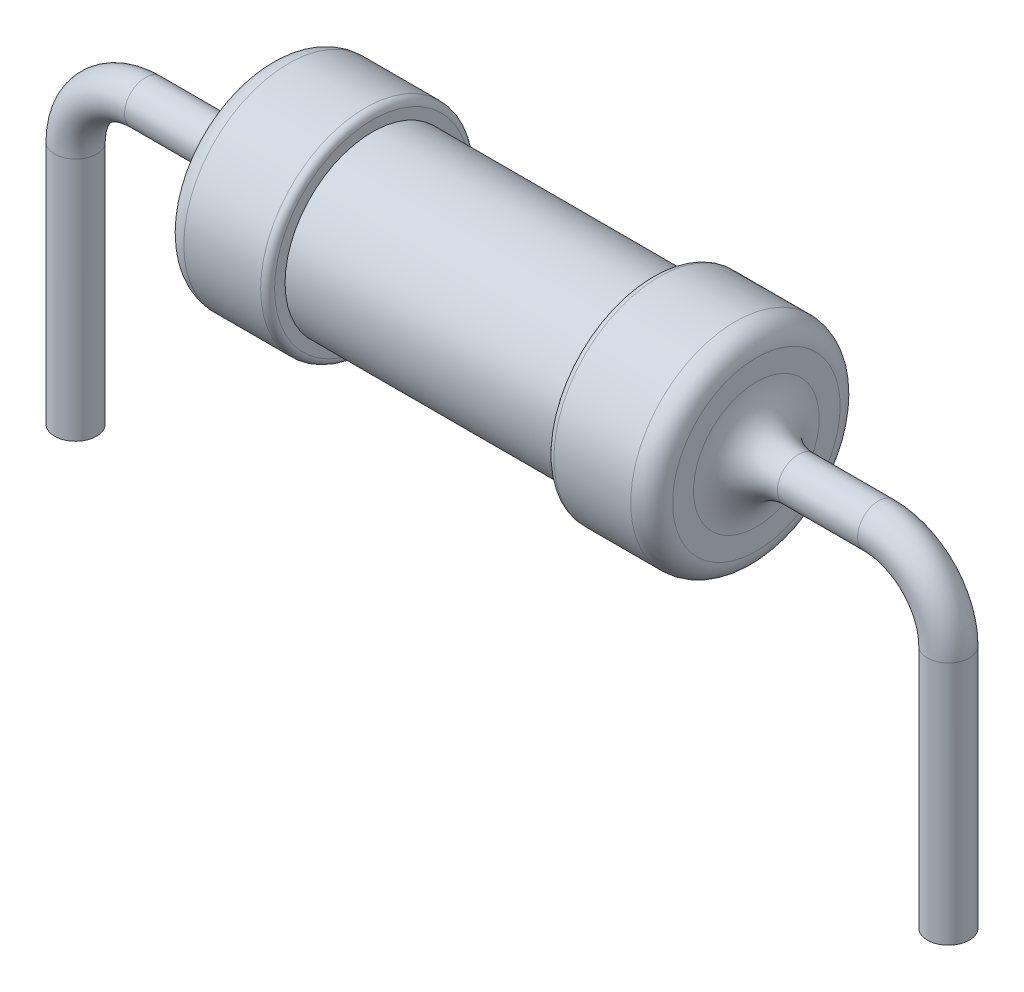
ISO-10303-21;
HEADER;
FILE_DESCRIPTION(('STEP AP214'),'2;1');
FILE_NAME('part.step','',(''),(''),'','','');
FILE_SCHEMA(('AUTOMOTIVE_DESIGN { 1 0 10303 214 1 1 1 1 }'));
ENDSEC;
DATA;
#1=APPLICATION_CONTEXT('core data for automotive mechanical design processes');
#2=APPLICATION_PROTOCOL_DEFINITION('international standard','automotive_design',2000,#1);
#3=PRODUCT_CONTEXT('',#1,'mechanical');
#4=PRODUCT('Part','Part','',(#3));
#5=PRODUCT_RELATED_PRODUCT_CATEGORY('part','',(#4));
#6=PRODUCT_DEFINITION_FORMATION('','',#4);
#7=PRODUCT_DEFINITION_CONTEXT('part definition',#1,'design');
#8=PRODUCT_DEFINITION('design','',#6,#7);
#9=PRODUCT_DEFINITION_SHAPE('','',#8);
#10=(LENGTH_UNIT() NAMED_UNIT(*) SI_UNIT(.MILLI.,.METRE.));
#11=(NAMED_UNIT(*) PLANE_ANGLE_UNIT() SI_UNIT($,.RADIAN.));
#12=(NAMED_UNIT(*) SI_UNIT($,.STERADIAN.) SOLID_ANGLE_UNIT());
#13=UNCERTAINTY_MEASURE_WITH_UNIT(LENGTH_MEASURE(1.E-05),#10,'distance_accuracy_value','');
#14=(GEOMETRIC_REPRESENTATION_CONTEXT(3) GLOBAL_UNCERTAINTY_ASSIGNED_CONTEXT((#13)) GLOBAL_UNIT_ASSIGNED_CONTEXT((#10,
#11,#12)) REPRESENTATION_CONTEXT('',''));
#15=CARTESIAN_POINT('',(0.,0.,0.));
#16=DIRECTION('',(0.,0.,1.));
#17=DIRECTION('',(1.,0.,0.));
#18=AXIS2_PLACEMENT_3D('',#15,#16,#17);
#19=CARTESIAN_POINT('',(2.5,0.,0.));
#20=DIRECTION('',(-1.,0.,0.));
#21=DIRECTION('',(0.,0.,1.));
#22=AXIS2_PLACEMENT_3D('',#19,#20,#21);
#23=CYLINDRICAL_SURFACE('',#22,1.25);
#24=CARTESIAN_POINT('',(2.,0.,0.));
#25=DIRECTION('',(1.,0.,0.));
#26=DIRECTION('',(0.,0.,-1.));
#27=AXIS2_PLACEMENT_3D('',#24,#25,#26);
#28=CIRCLE('',#27,1.25);
#29=CARTESIAN_POINT('',(2.,0.,-1.25));
#30=VERTEX_POINT('',#29);
#31=EDGE_CURVE('E101',#30,#30,#28,.T.);
#32=ORIENTED_EDGE('',*,*,#31,.F.);
#33=EDGE_LOOP('',(#32));
#34=FACE_BOUND('',#33,.T.);
#35=CARTESIAN_POINT('',(-2.,0.,0.));
#36=DIRECTION('',(-1.,0.,0.));
#37=DIRECTION('',(0.,0.,1.));
#38=AXIS2_PLACEMENT_3D('',#35,#36,#37);
#39=CIRCLE('',#38,1.25);
#40=CARTESIAN_POINT('',(-2.,0.,1.25));
#41=VERTEX_POINT('',#40);
#42=EDGE_CURVE('E97',#41,#41,#39,.T.);
#43=ORIENTED_EDGE('',*,*,#42,.F.);
#44=EDGE_LOOP('',(#43));
#45=FACE_BOUND('',#44,.T.);
#46=ADVANCED_FACE('F39',(#34,#45),#23,.T.);
#47=CARTESIAN_POINT('',(2.,0.,0.));
#48=DIRECTION('',(1.,0.,0.));
#49=DIRECTION('',(0.,0.,-1.));
#50=AXIS2_PLACEMENT_3D('',#47,#48,#49);
#51=CYLINDRICAL_SURFACE('',#50,1.5);
#52=CARTESIAN_POINT('',(2.1,0.,0.));
#53=DIRECTION('',(1.,0.,0.));
#54=DIRECTION('',(0.,0.,-1.));
#55=AXIS2_PLACEMENT_3D('',#52,#53,#54);
#56=CIRCLE('',#55,1.5);
#57=CARTESIAN_POINT('',(2.1,0.,-1.5));
#58=VERTEX_POINT('',#57);
#59=EDGE_CURVE('E47',#58,#58,#56,.T.);
#60=ORIENTED_EDGE('',*,*,#59,.T.);
#61=EDGE_LOOP('',(#60));
#62=FACE_BOUND('',#61,.T.);
#63=CARTESIAN_POINT('',(3.2,0.,0.));
#64=DIRECTION('',(1.,0.,0.));
#65=DIRECTION('',(0.,0.,-1.));
#66=AXIS2_PLACEMENT_3D('',#63,#64,#65);
#67=CIRCLE('',#66,1.5);
#68=CARTESIAN_POINT('',(3.2,0.,-1.5));
#69=VERTEX_POINT('',#68);
#70=EDGE_CURVE('E74',#69,#69,#67,.F.);
#71=ORIENTED_EDGE('',*,*,#70,.T.);
#72=EDGE_LOOP('',(#71));
#73=FACE_BOUND('',#72,.T.);
#74=ADVANCED_FACE('F146',(#62,#73),#51,.T.);
#75=CARTESIAN_POINT('',(2.,0.,0.));
#76=DIRECTION('',(1.,0.,0.));
#77=DIRECTION('',(0.,0.,-1.));
#78=AXIS2_PLACEMENT_3D('',#75,#76,#77);
#79=PLANE('',#78);
#80=CARTESIAN_POINT('',(2.,0.,0.));
#81=DIRECTION('',(1.,0.,0.));
#82=DIRECTION('',(0.,0.,-1.));
#83=AXIS2_PLACEMENT_3D('',#80,#81,#82);
#84=CIRCLE('',#83,1.4);
#85=CARTESIAN_POINT('',(2.,0.,-1.4));
#86=VERTEX_POINT('',#85);
#87=EDGE_CURVE('E10',#86,#86,#84,.F.);
#88=ORIENTED_EDGE('',*,*,#87,.T.);
#89=EDGE_LOOP('',(#88));
#90=FACE_BOUND('',#89,.T.);
#91=ORIENTED_EDGE('',*,*,#31,.T.);
#92=EDGE_LOOP('',(#91));
#93=FACE_BOUND('',#92,.T.);
#94=ADVANCED_FACE('F152',(#90,#93),#79,.F.);
#95=CARTESIAN_POINT('',(3.5,0.,0.));
#96=DIRECTION('',(1.,0.,0.));
#97=DIRECTION('',(0.,0.,-1.));
#98=AXIS2_PLACEMENT_3D('',#95,#96,#97);
#99=PLANE('',#98);
#100=CARTESIAN_POINT('',(3.5,0.,0.));
#101=DIRECTION('',(1.,0.,0.));
#102=DIRECTION('',(0.,0.,-1.));
#103=AXIS2_PLACEMENT_3D('',#100,#101,#102);
#104=CIRCLE('',#103,1.2);
#105=CARTESIAN_POINT('',(3.5,0.,-1.2));
#106=VERTEX_POINT('',#105);
#107=EDGE_CURVE('E78',#106,#106,#104,.T.);
#108=ORIENTED_EDGE('',*,*,#107,.T.);
#109=EDGE_LOOP('',(#108));
#110=FACE_BOUND('',#109,.T.);
#111=CARTESIAN_POINT('',(3.5,0.,0.));
#112=DIRECTION('',(1.,0.,0.));
#113=DIRECTION('',(0.,0.,-1.));
#114=AXIS2_PLACEMENT_3D('',#111,#112,#113);
#115=CIRCLE('',#114,0.9);
#116=CARTESIAN_POINT('',(3.5,0.,-0.9));
#117=VERTEX_POINT('',#116);
#118=EDGE_CURVE('E89',#117,#117,#115,.F.);
#119=ORIENTED_EDGE('',*,*,#118,.T.);
#120=EDGE_LOOP('',(#119));
#121=FACE_BOUND('',#120,.T.);
#122=ADVANCED_FACE('F189',(#110,#121),#99,.T.);
#123=CARTESIAN_POINT('',(-2.,0.,0.));
#124=DIRECTION('',(-1.,0.,0.));
#125=DIRECTION('',(0.,0.,1.));
#126=AXIS2_PLACEMENT_3D('',#123,#124,#125);
#127=CYLINDRICAL_SURFACE('',#126,1.5);
#128=CARTESIAN_POINT('',(-2.1,0.,0.));
#129=DIRECTION('',(-1.,0.,0.));
#130=DIRECTION('',(0.,0.,1.));
#131=AXIS2_PLACEMENT_3D('',#128,#129,#130);
#132=CIRCLE('',#131,1.5);
#133=CARTESIAN_POINT('',(-2.1,0.,1.5));
#134=VERTEX_POINT('',#133);
#135=EDGE_CURVE('E61',#134,#134,#132,.T.);
#136=ORIENTED_EDGE('',*,*,#135,.T.);
#137=EDGE_LOOP('',(#136));
#138=FACE_BOUND('',#137,.T.);
#139=CARTESIAN_POINT('',(-3.2,0.,0.));
#140=DIRECTION('',(-1.,0.,0.));
#141=DIRECTION('',(0.,0.,1.));
#142=AXIS2_PLACEMENT_3D('',#139,#140,#141);
#143=CIRCLE('',#142,1.5);
#144=CARTESIAN_POINT('',(-3.2,0.,1.5));
#145=VERTEX_POINT('',#144);
#146=EDGE_CURVE('E67',#145,#145,#143,.F.);
#147=ORIENTED_EDGE('',*,*,#146,.T.);
#148=EDGE_LOOP('',(#147));
#149=FACE_BOUND('',#148,.T.);
#150=ADVANCED_FACE('F186',(#138,#149),#127,.T.);
#151=CARTESIAN_POINT('',(-2.,0.,0.));
#152=DIRECTION('',(-1.,0.,0.));
#153=DIRECTION('',(0.,0.,1.));
#154=AXIS2_PLACEMENT_3D('',#151,#152,#153);
#155=PLANE('',#154);
#156=CARTESIAN_POINT('',(-2.,0.,0.));
#157=DIRECTION('',(-1.,0.,0.));
#158=DIRECTION('',(0.,0.,1.));
#159=AXIS2_PLACEMENT_3D('',#156,#157,#158);
#160=CIRCLE('',#159,1.4);
#161=CARTESIAN_POINT('',(-2.,0.,1.4));
#162=VERTEX_POINT('',#161);
#163=EDGE_CURVE('E54',#162,#162,#160,.F.);
#164=ORIENTED_EDGE('',*,*,#163,.T.);
#165=EDGE_LOOP('',(#164));
#166=FACE_BOUND('',#165,.T.);
#167=ORIENTED_EDGE('',*,*,#42,.T.);
#168=EDGE_LOOP('',(#167));
#169=FACE_BOUND('',#168,.T.);
#170=ADVANCED_FACE('F141',(#166,#169),#155,.F.);
#171=CARTESIAN_POINT('',(-3.5,0.,0.));
#172=DIRECTION('',(-1.,0.,0.));
#173=DIRECTION('',(0.,0.,1.));
#174=AXIS2_PLACEMENT_3D('',#171,#172,#173);
#175=PLANE('',#174);
#176=CARTESIAN_POINT('',(-3.5,0.,0.));
#177=DIRECTION('',(-1.,0.,0.));
#178=DIRECTION('',(0.,0.,1.));
#179=AXIS2_PLACEMENT_3D('',#176,#177,#178);
#180=CIRCLE('',#179,1.2);
#181=CARTESIAN_POINT('',(-3.5,0.,1.2));
#182=VERTEX_POINT('',#181);
#183=EDGE_CURVE('E70',#182,#182,#180,.T.);
#184=ORIENTED_EDGE('',*,*,#183,.T.);
#185=EDGE_LOOP('',(#184));
#186=FACE_BOUND('',#185,.T.);
#187=CARTESIAN_POINT('',(-3.5,0.,0.));
#188=DIRECTION('',(-1.,0.,0.));
#189=DIRECTION('',(0.,0.,1.));
#190=AXIS2_PLACEMENT_3D('',#187,#188,#189);
#191=CIRCLE('',#190,0.9);
#192=CARTESIAN_POINT('',(-3.5,0.,0.9));
#193=VERTEX_POINT('',#192);
#194=EDGE_CURVE('E82',#193,#193,#191,.F.);
#195=ORIENTED_EDGE('',*,*,#194,.T.);
#196=EDGE_LOOP('',(#195));
#197=FACE_BOUND('',#196,.T.);
#198=ADVANCED_FACE('F132',(#186,#197),#175,.T.);
#199=CARTESIAN_POINT('',(-6.25,-4.5,0.));
#200=DIRECTION('',(0.,1.,0.));
#201=DIRECTION('',(0.,0.,-1.));
#202=AXIS2_PLACEMENT_3D('',#199,#200,#201);
#203=PLANE('',#202);
#204=CARTESIAN_POINT('',(-6.25,-4.5,0.));
#205=DIRECTION('',(0.,1.,0.));
#206=DIRECTION('',(0.,0.,-1.));
#207=AXIS2_PLACEMENT_3D('',#204,#205,#206);
#208=CIRCLE('',#207,0.3);
#209=CARTESIAN_POINT('',(-6.25,-4.5,-0.3));
#210=VERTEX_POINT('',#209);
#211=EDGE_CURVE('E123',#210,#210,#208,.T.);
#212=ORIENTED_EDGE('',*,*,#211,.F.);
#213=EDGE_LOOP('',(#212));
#214=FACE_BOUND('',#213,.T.);
#215=ADVANCED_FACE('F130',(#214),#203,.F.);
#216=CARTESIAN_POINT('',(-6.25,-4.5,0.));
#217=DIRECTION('',(0.,1.,0.));
#218=DIRECTION('',(0.,0.,1.));
#219=AXIS2_PLACEMENT_3D('',#216,#217,#218);
#220=CYLINDRICAL_SURFACE('',#219,0.3);
#221=CARTESIAN_POINT('',(-6.25,-0.999999999999999,0.));
#222=DIRECTION('',(0.,1.,0.));
#223=DIRECTION('',(0.,0.,-1.));
#224=AXIS2_PLACEMENT_3D('',#221,#222,#223);
#225=CIRCLE('',#224,0.3);
#226=CARTESIAN_POINT('',(-6.55,-0.999999999999999,0.));
#227=VERTEX_POINT('',#226);
#228=EDGE_CURVE('E119',#227,#227,#225,.T.);
#229=ORIENTED_EDGE('',*,*,#228,.F.);
#230=EDGE_LOOP('',(#229));
#231=FACE_BOUND('',#230,.T.);
#232=ORIENTED_EDGE('',*,*,#211,.T.);
#233=EDGE_LOOP('',(#232));
#234=FACE_BOUND('',#233,.T.);
#235=ADVANCED_FACE('F128',(#231,#234),#220,.T.);
#236=CARTESIAN_POINT('',(-5.25,-1.,0.));
#237=DIRECTION('',(0.,0.,-1.));
#238=DIRECTION('',(-1.,0.,0.));
#239=AXIS2_PLACEMENT_3D('',#236,#237,#238);
#240=TOROIDAL_SURFACE('',#239,1.,0.3);
#241=CARTESIAN_POINT('',(-5.25,0.,0.));
#242=DIRECTION('',(1.,0.,0.));
#243=DIRECTION('',(0.,0.,-1.));
#244=AXIS2_PLACEMENT_3D('',#241,#242,#243);
#245=CIRCLE('',#244,0.3);
#246=CARTESIAN_POINT('',(-5.25,0.3,0.));
#247=VERTEX_POINT('',#246);
#248=EDGE_CURVE('E115',#247,#247,#245,.T.);
#249=CARTESIAN_POINT('',(-5.25,-1.,0.));
#250=DIRECTION('',(0.,0.,-1.));
#251=DIRECTION('',(-1.,0.,0.));
#252=AXIS2_PLACEMENT_3D('',#249,#250,#251);
#253=CIRCLE('',#252,1.3);
#254=EDGE_CURVE('',#227,#247,#253,.T.);
#255=ORIENTED_EDGE('',*,*,#228,.T.);
#256=ORIENTED_EDGE('',*,*,#248,.F.);
#257=ORIENTED_EDGE('',*,*,#254,.T.);
#258=ORIENTED_EDGE('',*,*,#254,.F.);
#259=EDGE_LOOP('',(#255,#257,#256,#258));
#260=FACE_BOUND('',#259,.T.);
#261=ADVANCED_FACE('F138',(#260),#240,.T.);
#262=CARTESIAN_POINT('',(-5.25,0.,0.));
#263=DIRECTION('',(1.,0.,0.));
#264=DIRECTION('',(0.,0.,-1.));
#265=AXIS2_PLACEMENT_3D('',#262,#263,#264);
#266=CYLINDRICAL_SURFACE('',#265,0.3);
#267=CARTESIAN_POINT('',(-4.1,0.,0.));
#268=DIRECTION('',(-1.,0.,0.));
#269=DIRECTION('',(0.,0.,1.));
#270=AXIS2_PLACEMENT_3D('',#267,#268,#269);
#271=CIRCLE('',#270,0.3);
#272=CARTESIAN_POINT('',(-4.1,0.,0.3));
#273=VERTEX_POINT('',#272);
#274=EDGE_CURVE('E85',#273,#273,#271,.T.);
#275=ORIENTED_EDGE('',*,*,#274,.T.);
#276=EDGE_LOOP('',(#275));
#277=FACE_BOUND('',#276,.T.);
#278=ORIENTED_EDGE('',*,*,#248,.T.);
#279=EDGE_LOOP('',(#278));
#280=FACE_BOUND('',#279,.T.);
#281=ADVANCED_FACE('F199',(#277,#280),#266,.T.);
#282=CARTESIAN_POINT('',(6.25,-4.5,0.));
#283=DIRECTION('',(0.,-1.,0.));
#284=DIRECTION('',(0.,0.,-1.));
#285=AXIS2_PLACEMENT_3D('',#282,#283,#284);
#286=PLANE('',#285);
#287=CARTESIAN_POINT('',(6.25,-4.5,0.));
#288=DIRECTION('',(0.,-1.,0.));
#289=DIRECTION('',(0.,0.,-1.));
#290=AXIS2_PLACEMENT_3D('',#287,#288,#289);
#291=CIRCLE('',#290,0.3);
#292=CARTESIAN_POINT('',(6.25,-4.5,-0.299999999999999));
#293=VERTEX_POINT('',#292);
#294=EDGE_CURVE('E105',#293,#293,#291,.T.);
#295=ORIENTED_EDGE('',*,*,#294,.T.);
#296=EDGE_LOOP('',(#295));
#297=FACE_BOUND('',#296,.T.);
#298=ADVANCED_FACE('F164',(#297),#286,.T.);
#299=CARTESIAN_POINT('',(0.,0.,0.));
#300=DIRECTION('',(1.,0.,0.));
#301=DIRECTION('',(0.,0.,-1.));
#302=AXIS2_PLACEMENT_3D('',#299,#300,#301);
#303=CYLINDRICAL_SURFACE('',#302,0.3);
#304=CARTESIAN_POINT('',(4.1,0.,0.));
#305=DIRECTION('',(1.,0.,0.));
#306=DIRECTION('',(0.,0.,-1.));
#307=AXIS2_PLACEMENT_3D('',#304,#305,#306);
#308=CIRCLE('',#307,0.3);
#309=CARTESIAN_POINT('',(4.1,0.,-0.3));
#310=VERTEX_POINT('',#309);
#311=EDGE_CURVE('E93',#310,#310,#308,.T.);
#312=ORIENTED_EDGE('',*,*,#311,.T.);
#313=EDGE_LOOP('',(#312));
#314=FACE_BOUND('',#313,.T.);
#315=CARTESIAN_POINT('',(5.25,0.,0.));
#316=DIRECTION('',(1.,0.,0.));
#317=DIRECTION('',(0.,0.,-1.));
#318=AXIS2_PLACEMENT_3D('',#315,#316,#317);
#319=CIRCLE('',#318,0.3);
#320=CARTESIAN_POINT('',(5.25,0.3,0.));
#321=VERTEX_POINT('',#320);
#322=EDGE_CURVE('E112',#321,#321,#319,.T.);
#323=ORIENTED_EDGE('',*,*,#322,.F.);
#324=EDGE_LOOP('',(#323));
#325=FACE_BOUND('',#324,.T.);
#326=ADVANCED_FACE('F212',(#314,#325),#303,.T.);
#327=CARTESIAN_POINT('',(5.25,-1.,0.));
#328=DIRECTION('',(0.,0.,-1.));
#329=DIRECTION('',(-1.,0.,0.));
#330=AXIS2_PLACEMENT_3D('',#327,#328,#329);
#331=TOROIDAL_SURFACE('',#330,1.,0.3);
#332=CARTESIAN_POINT('',(6.25,-1.,0.));
#333=DIRECTION('',(0.,-1.,0.));
#334=DIRECTION('',(0.,0.,-1.));
#335=AXIS2_PLACEMENT_3D('',#332,#333,#334);
#336=CIRCLE('',#335,0.3);
#337=CARTESIAN_POINT('',(6.55,-1.,0.));
#338=VERTEX_POINT('',#337);
#339=EDGE_CURVE('E108',#338,#338,#336,.T.);
#340=CARTESIAN_POINT('',(5.25,-1.,0.));
#341=DIRECTION('',(0.,0.,-1.));
#342=DIRECTION('',(-1.,0.,0.));
#343=AXIS2_PLACEMENT_3D('',#340,#341,#342);
#344=CIRCLE('',#343,1.3);
#345=EDGE_CURVE('',#321,#338,#344,.T.);
#346=ORIENTED_EDGE('',*,*,#322,.T.);
#347=ORIENTED_EDGE('',*,*,#339,.F.);
#348=ORIENTED_EDGE('',*,*,#345,.T.);
#349=ORIENTED_EDGE('',*,*,#345,.F.);
#350=EDGE_LOOP('',(#346,#348,#347,#349));
#351=FACE_BOUND('',#350,.T.);
#352=ADVANCED_FACE('F215',(#351),#331,.T.);
#353=CARTESIAN_POINT('',(6.25,-1.,0.));
#354=DIRECTION('',(0.,-1.,0.));
#355=DIRECTION('',(0.,0.,-1.));
#356=AXIS2_PLACEMENT_3D('',#353,#354,#355);
#357=CYLINDRICAL_SURFACE('',#356,0.3);
#358=ORIENTED_EDGE('',*,*,#294,.F.);
#359=EDGE_LOOP('',(#358));
#360=FACE_BOUND('',#359,.T.);
#361=ORIENTED_EDGE('',*,*,#339,.T.);
#362=EDGE_LOOP('',(#361));
#363=FACE_BOUND('',#362,.T.);
#364=ADVANCED_FACE('F162',(#360,#363),#357,.T.);
#365=CARTESIAN_POINT('',(4.1,0.,0.));
#366=DIRECTION('',(1.,0.,0.));
#367=DIRECTION('',(0.,0.,-1.));
#368=AXIS2_PLACEMENT_3D('',#365,#366,#367);
#369=TOROIDAL_SURFACE('',#368,0.9,0.6);
#370=ORIENTED_EDGE('',*,*,#118,.F.);
#371=EDGE_LOOP('',(#370));
#372=FACE_BOUND('',#371,.T.);
#373=ORIENTED_EDGE('',*,*,#311,.F.);
#374=EDGE_LOOP('',(#373));
#375=FACE_BOUND('',#374,.T.);
#376=ADVANCED_FACE('F158',(#372,#375),#369,.F.);
#377=CARTESIAN_POINT('',(-4.1,0.,0.));
#378=DIRECTION('',(-1.,0.,0.));
#379=DIRECTION('',(0.,0.,1.));
#380=AXIS2_PLACEMENT_3D('',#377,#378,#379);
#381=TOROIDAL_SURFACE('',#380,0.9,0.6);
#382=ORIENTED_EDGE('',*,*,#194,.F.);
#383=EDGE_LOOP('',(#382));
#384=FACE_BOUND('',#383,.T.);
#385=ORIENTED_EDGE('',*,*,#274,.F.);
#386=EDGE_LOOP('',(#385));
#387=FACE_BOUND('',#386,.T.);
#388=ADVANCED_FACE('F161',(#384,#387),#381,.F.);
#389=CARTESIAN_POINT('',(3.2,0.,0.));
#390=DIRECTION('',(1.,0.,0.));
#391=DIRECTION('',(0.,0.,-1.));
#392=AXIS2_PLACEMENT_3D('',#389,#390,#391);
#393=TOROIDAL_SURFACE('',#392,1.2,0.3);
#394=ORIENTED_EDGE('',*,*,#70,.F.);
#395=EDGE_LOOP('',(#394));
#396=FACE_BOUND('',#395,.T.);
#397=ORIENTED_EDGE('',*,*,#107,.F.);
#398=EDGE_LOOP('',(#397));
#399=FACE_BOUND('',#398,.T.);
#400=ADVANCED_FACE('F167',(#396,#399),#393,.T.);
#401=CARTESIAN_POINT('',(-3.2,0.,0.));
#402=DIRECTION('',(-1.,0.,0.));
#403=DIRECTION('',(0.,0.,1.));
#404=AXIS2_PLACEMENT_3D('',#401,#402,#403);
#405=TOROIDAL_SURFACE('',#404,1.2,0.3);
#406=ORIENTED_EDGE('',*,*,#146,.F.);
#407=EDGE_LOOP('',(#406));
#408=FACE_BOUND('',#407,.T.);
#409=ORIENTED_EDGE('',*,*,#183,.F.);
#410=EDGE_LOOP('',(#409));
#411=FACE_BOUND('',#410,.T.);
#412=ADVANCED_FACE('F171',(#408,#411),#405,.T.);
#413=CARTESIAN_POINT('',(-2.1,0.,0.));
#414=DIRECTION('',(-1.,0.,0.));
#415=DIRECTION('',(0.,0.,1.));
#416=AXIS2_PLACEMENT_3D('',#413,#414,#415);
#417=TOROIDAL_SURFACE('',#416,1.4,0.1);
#418=ORIENTED_EDGE('',*,*,#163,.F.);
#419=EDGE_LOOP('',(#418));
#420=FACE_BOUND('',#419,.T.);
#421=ORIENTED_EDGE('',*,*,#135,.F.);
#422=EDGE_LOOP('',(#421));
#423=FACE_BOUND('',#422,.T.);
#424=ADVANCED_FACE('F174',(#420,#423),#417,.T.);
#425=CARTESIAN_POINT('',(2.1,0.,0.));
#426=DIRECTION('',(1.,0.,0.));
#427=DIRECTION('',(0.,0.,-1.));
#428=AXIS2_PLACEMENT_3D('',#425,#426,#427);
#429=TOROIDAL_SURFACE('',#428,1.4,0.1);
#430=ORIENTED_EDGE('',*,*,#87,.F.);
#431=EDGE_LOOP('',(#430));
#432=FACE_BOUND('',#431,.T.);
#433=ORIENTED_EDGE('',*,*,#59,.F.);
#434=EDGE_LOOP('',(#433));
#435=FACE_BOUND('',#434,.T.);
#436=ADVANCED_FACE('F41',(#432,#435),#429,.T.);
#437=CLOSED_SHELL('',(#46,#74,#94,#122,#150,#170,#198,#215,#235,#261,#281,#298,#326,#352,#364,
#376,#388,#400,#412,#424,#436));
#438=MANIFOLD_SOLID_BREP('B2',#437);
#439=ADVANCED_BREP_SHAPE_REPRESENTATION('',(#18,#438),#14);
#440=SHAPE_DEFINITION_REPRESENTATION(#9,#439);
ENDSEC;
END-ISO-10303-21;
